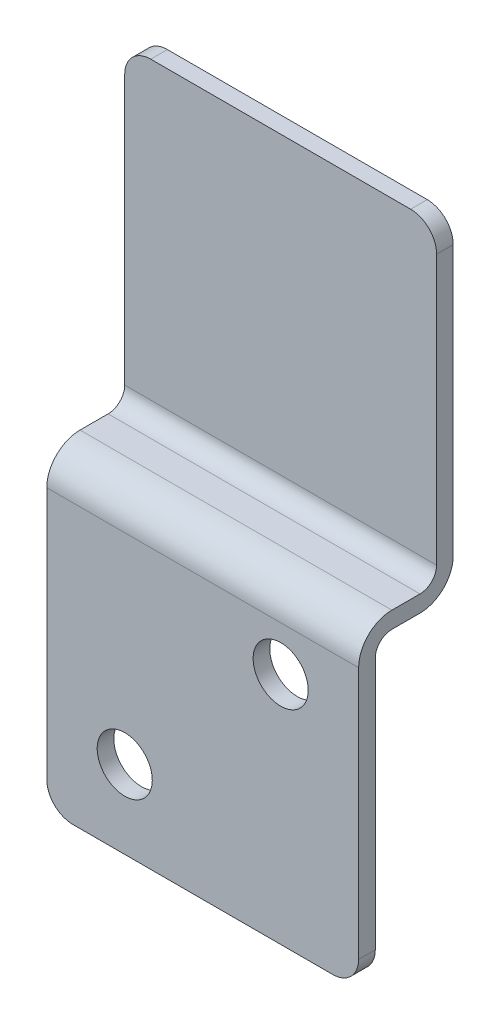
ISO-10303-21;
HEADER;
FILE_DESCRIPTION(('STEP AP214'),'2;1');
FILE_NAME('part.step','',(''),(''),'','','');
FILE_SCHEMA(('AUTOMOTIVE_DESIGN { 1 0 10303 214 1 1 1 1 }'));
ENDSEC;
DATA;
#1=APPLICATION_CONTEXT('core data for automotive mechanical design processes');
#2=APPLICATION_PROTOCOL_DEFINITION('international standard','automotive_design',2000,#1);
#3=PRODUCT_CONTEXT('',#1,'mechanical');
#4=PRODUCT('Part','Part','',(#3));
#5=PRODUCT_RELATED_PRODUCT_CATEGORY('part','',(#4));
#6=PRODUCT_DEFINITION_FORMATION('','',#4);
#7=PRODUCT_DEFINITION_CONTEXT('part definition',#1,'design');
#8=PRODUCT_DEFINITION('design','',#6,#7);
#9=PRODUCT_DEFINITION_SHAPE('','',#8);
#10=(LENGTH_UNIT() NAMED_UNIT(*) SI_UNIT(.MILLI.,.METRE.));
#11=(NAMED_UNIT(*) PLANE_ANGLE_UNIT() SI_UNIT($,.RADIAN.));
#12=(NAMED_UNIT(*) SI_UNIT($,.STERADIAN.) SOLID_ANGLE_UNIT());
#13=UNCERTAINTY_MEASURE_WITH_UNIT(LENGTH_MEASURE(1.E-05),#10,'distance_accuracy_value','');
#14=(GEOMETRIC_REPRESENTATION_CONTEXT(3) GLOBAL_UNCERTAINTY_ASSIGNED_CONTEXT((#13)) GLOBAL_UNIT_ASSIGNED_CONTEXT((#10,
#11,#12)) REPRESENTATION_CONTEXT('',''));
#15=CARTESIAN_POINT('',(0.,0.,0.));
#16=DIRECTION('',(0.,0.,1.));
#17=DIRECTION('',(1.,0.,0.));
#18=AXIS2_PLACEMENT_3D('',#15,#16,#17);
#19=CARTESIAN_POINT('',(38.1,0.,0.));
#20=DIRECTION('',(0.,-1.,0.));
#21=DIRECTION('',(0.,0.,-1.));
#22=AXIS2_PLACEMENT_3D('',#19,#20,#21);
#23=PLANE('',#22);
#24=DIRECTION('',(-1.,0.,0.));
#25=VECTOR('',#24,1.);
#26=CARTESIAN_POINT('',(38.1,0.,-2.032));
#27=LINE('',#26,#25);
#28=CARTESIAN_POINT('',(34.925,0.,-2.032));
#29=VERTEX_POINT('',#28);
#30=CARTESIAN_POINT('',(3.17500000000001,0.,-2.032));
#31=VERTEX_POINT('',#30);
#32=EDGE_CURVE('E192',#29,#31,#27,.T.);
#33=ORIENTED_EDGE('',*,*,#32,.T.);
#34=DIRECTION('',(0.,0.,1.));
#35=VECTOR('',#34,1.);
#36=CARTESIAN_POINT('',(3.175,0.,0.));
#37=LINE('',#36,#35);
#38=CARTESIAN_POINT('',(3.17500000000001,0.,0.));
#39=VERTEX_POINT('',#38);
#40=EDGE_CURVE('E252',#31,#39,#37,.T.);
#41=ORIENTED_EDGE('',*,*,#40,.T.);
#42=DIRECTION('',(-1.,0.,0.));
#43=VECTOR('',#42,1.);
#44=CARTESIAN_POINT('',(38.1,0.,0.));
#45=LINE('',#44,#43);
#46=CARTESIAN_POINT('',(34.925,0.,0.));
#47=VERTEX_POINT('',#46);
#48=EDGE_CURVE('E177',#47,#39,#45,.T.);
#49=ORIENTED_EDGE('',*,*,#48,.F.);
#50=DIRECTION('',(0.,0.,1.));
#51=VECTOR('',#50,1.);
#52=CARTESIAN_POINT('',(34.925,0.,0.));
#53=LINE('',#52,#51);
#54=EDGE_CURVE('E250',#47,#29,#53,.F.);
#55=ORIENTED_EDGE('',*,*,#54,.T.);
#56=EDGE_LOOP('',(#33,#41,#49,#55));
#57=FACE_BOUND('',#56,.T.);
#58=ADVANCED_FACE('F37',(#57),#23,.F.);
#59=CARTESIAN_POINT('',(38.1,0.,0.));
#60=DIRECTION('',(0.,0.,-1.));
#61=DIRECTION('',(0.,1.,0.));
#62=AXIS2_PLACEMENT_3D('',#59,#60,#61);
#63=PLANE('',#62);
#64=ORIENTED_EDGE('',*,*,#48,.T.);
#65=CARTESIAN_POINT('',(3.175,-3.175,0.));
#66=DIRECTION('',(0.,0.,-1.));
#67=DIRECTION('',(0.,1.,0.));
#68=AXIS2_PLACEMENT_3D('',#65,#66,#67);
#69=CIRCLE('',#68,3.175);
#70=CARTESIAN_POINT('',(0.,-3.175,0.));
#71=VERTEX_POINT('',#70);
#72=EDGE_CURVE('E256',#39,#71,#69,.F.);
#73=ORIENTED_EDGE('',*,*,#72,.T.);
#74=DIRECTION('',(0.,-1.,0.));
#75=VECTOR('',#74,1.);
#76=CARTESIAN_POINT('',(0.,0.,0.));
#77=LINE('',#76,#75);
#78=CARTESIAN_POINT('',(0.,-36.068,0.));
#79=VERTEX_POINT('',#78);
#80=EDGE_CURVE('E267',#71,#79,#77,.T.);
#81=ORIENTED_EDGE('',*,*,#80,.T.);
#82=DIRECTION('',(-1.,0.,0.));
#83=VECTOR('',#82,1.);
#84=CARTESIAN_POINT('',(38.1,-36.068,0.));
#85=LINE('',#84,#83);
#86=CARTESIAN_POINT('',(38.1,-36.068,0.));
#87=VERTEX_POINT('',#86);
#88=EDGE_CURVE('E167',#79,#87,#85,.F.);
#89=ORIENTED_EDGE('',*,*,#88,.T.);
#90=DIRECTION('',(0.,-1.,0.));
#91=VECTOR('',#90,1.);
#92=CARTESIAN_POINT('',(38.1,0.,0.));
#93=LINE('',#92,#91);
#94=CARTESIAN_POINT('',(38.1,-3.175,0.));
#95=VERTEX_POINT('',#94);
#96=EDGE_CURVE('E186',#95,#87,#93,.T.);
#97=ORIENTED_EDGE('',*,*,#96,.F.);
#98=CARTESIAN_POINT('',(34.925,-3.175,0.));
#99=DIRECTION('',(0.,0.,-1.));
#100=DIRECTION('',(0.,1.,0.));
#101=AXIS2_PLACEMENT_3D('',#98,#99,#100);
#102=CIRCLE('',#101,3.175);
#103=EDGE_CURVE('E62',#95,#47,#102,.F.);
#104=ORIENTED_EDGE('',*,*,#103,.T.);
#105=EDGE_LOOP('',(#64,#73,#81,#89,#97,#104));
#106=FACE_BOUND('',#105,.T.);
#107=ADVANCED_FACE('F339',(#106),#63,.F.);
#108=CARTESIAN_POINT('',(38.1,-38.1,0.));
#109=DIRECTION('',(0.,-1.,0.));
#110=DIRECTION('',(0.,0.,-1.));
#111=AXIS2_PLACEMENT_3D('',#108,#109,#110);
#112=PLANE('',#111);
#113=DIRECTION('',(0.,0.,1.));
#114=VECTOR('',#113,1.);
#115=CARTESIAN_POINT('',(0.,-38.1,0.));
#116=LINE('',#115,#114);
#117=CARTESIAN_POINT('',(0.,-38.1,2.032));
#118=VERTEX_POINT('',#117);
#119=CARTESIAN_POINT('',(0.,-38.1,5.461));
#120=VERTEX_POINT('',#119);
#121=EDGE_CURVE('E288',#118,#120,#116,.T.);
#122=ORIENTED_EDGE('',*,*,#121,.T.);
#123=DIRECTION('',(-1.,0.,0.));
#124=VECTOR('',#123,1.);
#125=CARTESIAN_POINT('',(38.1,-38.1,5.461));
#126=LINE('',#125,#124);
#127=CARTESIAN_POINT('',(38.1,-38.1,5.461));
#128=VERTEX_POINT('',#127);
#129=EDGE_CURVE('E222',#120,#128,#126,.F.);
#130=ORIENTED_EDGE('',*,*,#129,.T.);
#131=DIRECTION('',(0.,0.,1.));
#132=VECTOR('',#131,1.);
#133=CARTESIAN_POINT('',(38.1,-38.1,0.));
#134=LINE('',#133,#132);
#135=CARTESIAN_POINT('',(38.1,-38.1,2.032));
#136=VERTEX_POINT('',#135);
#137=EDGE_CURVE('E277',#136,#128,#134,.T.);
#138=ORIENTED_EDGE('',*,*,#137,.F.);
#139=DIRECTION('',(-1.,0.,0.));
#140=VECTOR('',#139,1.);
#141=CARTESIAN_POINT('',(0.,-38.1,2.032));
#142=LINE('',#141,#140);
#143=EDGE_CURVE('E205',#136,#118,#142,.T.);
#144=ORIENTED_EDGE('',*,*,#143,.T.);
#145=EDGE_LOOP('',(#122,#130,#138,#144));
#146=FACE_BOUND('',#145,.T.);
#147=ADVANCED_FACE('F321',(#146),#112,.F.);
#148=CARTESIAN_POINT('',(38.1,-38.1,9.525));
#149=DIRECTION('',(0.,0.,-1.));
#150=DIRECTION('',(0.,1.,0.));
#151=AXIS2_PLACEMENT_3D('',#148,#149,#150);
#152=PLANE('',#151);
#153=CARTESIAN_POINT('',(9.525,-66.675,9.52500000000001));
#154=DIRECTION('',(0.,0.,1.));
#155=DIRECTION('',(1.,0.,0.));
#156=AXIS2_PLACEMENT_3D('',#153,#154,#155);
#157=CIRCLE('',#156,3.3655);
#158=CARTESIAN_POINT('',(12.8905,-66.675,9.52500000000001));
#159=VERTEX_POINT('',#158);
#160=EDGE_CURVE('E263',#159,#159,#157,.T.);
#161=ORIENTED_EDGE('',*,*,#160,.F.);
#162=EDGE_LOOP('',(#161));
#163=FACE_BOUND('',#162,.T.);
#164=CARTESIAN_POINT('',(28.575,-47.625,9.52500000000001));
#165=DIRECTION('',(0.,0.,1.));
#166=DIRECTION('',(1.,0.,0.));
#167=AXIS2_PLACEMENT_3D('',#164,#165,#166);
#168=CIRCLE('',#167,3.36549999999999);
#169=CARTESIAN_POINT('',(31.9405,-47.625,9.52500000000001));
#170=VERTEX_POINT('',#169);
#171=EDGE_CURVE('E269',#170,#170,#168,.T.);
#172=ORIENTED_EDGE('',*,*,#171,.F.);
#173=EDGE_LOOP('',(#172));
#174=FACE_BOUND('',#173,.T.);
#175=DIRECTION('',(0.,-1.,0.));
#176=VECTOR('',#175,1.);
#177=CARTESIAN_POINT('',(0.,-38.1,9.525));
#178=LINE('',#177,#176);
#179=CARTESIAN_POINT('',(0.,-42.164,9.525));
#180=VERTEX_POINT('',#179);
#181=CARTESIAN_POINT('',(0.,-73.025,9.52499999999999));
#182=VERTEX_POINT('',#181);
#183=EDGE_CURVE('E188',#180,#182,#178,.T.);
#184=ORIENTED_EDGE('',*,*,#183,.T.);
#185=CARTESIAN_POINT('',(3.175,-73.025,9.52499999999999));
#186=DIRECTION('',(0.,0.,-1.));
#187=DIRECTION('',(0.,1.,0.));
#188=AXIS2_PLACEMENT_3D('',#185,#186,#187);
#189=CIRCLE('',#188,3.175);
#190=CARTESIAN_POINT('',(3.17500000000001,-76.2,9.52499999999999));
#191=VERTEX_POINT('',#190);
#192=EDGE_CURVE('E248',#182,#191,#189,.F.);
#193=ORIENTED_EDGE('',*,*,#192,.T.);
#194=DIRECTION('',(-1.,0.,0.));
#195=VECTOR('',#194,1.);
#196=CARTESIAN_POINT('',(38.1,-76.2,9.52499999999999));
#197=LINE('',#196,#195);
#198=CARTESIAN_POINT('',(34.925,-76.2,9.52499999999999));
#199=VERTEX_POINT('',#198);
#200=EDGE_CURVE('E199',#199,#191,#197,.T.);
#201=ORIENTED_EDGE('',*,*,#200,.F.);
#202=CARTESIAN_POINT('',(34.925,-73.025,9.52499999999999));
#203=DIRECTION('',(0.,0.,-1.));
#204=DIRECTION('',(0.,1.,0.));
#205=AXIS2_PLACEMENT_3D('',#202,#203,#204);
#206=CIRCLE('',#205,3.175);
#207=CARTESIAN_POINT('',(38.1,-73.025,9.52499999999999));
#208=VERTEX_POINT('',#207);
#209=EDGE_CURVE('E246',#199,#208,#206,.F.);
#210=ORIENTED_EDGE('',*,*,#209,.T.);
#211=DIRECTION('',(0.,-1.,0.));
#212=VECTOR('',#211,1.);
#213=CARTESIAN_POINT('',(38.1,-38.1,9.525));
#214=LINE('',#213,#212);
#215=CARTESIAN_POINT('',(38.1,-42.164,9.525));
#216=VERTEX_POINT('',#215);
#217=EDGE_CURVE('E280',#216,#208,#214,.T.);
#218=ORIENTED_EDGE('',*,*,#217,.F.);
#219=DIRECTION('',(-1.,0.,0.));
#220=VECTOR('',#219,1.);
#221=CARTESIAN_POINT('',(38.1,-42.164,9.525));
#222=LINE('',#221,#220);
#223=EDGE_CURVE('E216',#216,#180,#222,.T.);
#224=ORIENTED_EDGE('',*,*,#223,.T.);
#225=EDGE_LOOP('',(#184,#193,#201,#210,#218,#224));
#226=FACE_BOUND('',#225,.T.);
#227=ADVANCED_FACE('F294',(#163,#174,#226),#152,.F.);
#228=CARTESIAN_POINT('',(38.1,-76.2,9.52499999999999));
#229=DIRECTION('',(0.,1.,0.));
#230=DIRECTION('',(0.,0.,1.));
#231=AXIS2_PLACEMENT_3D('',#228,#229,#230);
#232=PLANE('',#231);
#233=ORIENTED_EDGE('',*,*,#200,.T.);
#234=DIRECTION('',(0.,0.,-1.));
#235=VECTOR('',#234,1.);
#236=CARTESIAN_POINT('',(3.175,-76.2,7.49299999999999));
#237=LINE('',#236,#235);
#238=CARTESIAN_POINT('',(3.17500000000001,-76.2,7.49299999999999));
#239=VERTEX_POINT('',#238);
#240=EDGE_CURVE('E235',#191,#239,#237,.T.);
#241=ORIENTED_EDGE('',*,*,#240,.T.);
#242=DIRECTION('',(-1.,0.,0.));
#243=VECTOR('',#242,1.);
#244=CARTESIAN_POINT('',(38.1,-76.2,7.49299999999999));
#245=LINE('',#244,#243);
#246=CARTESIAN_POINT('',(34.925,-76.2,7.49299999999999));
#247=VERTEX_POINT('',#246);
#248=EDGE_CURVE('E195',#247,#239,#245,.T.);
#249=ORIENTED_EDGE('',*,*,#248,.F.);
#250=DIRECTION('',(0.,0.,-1.));
#251=VECTOR('',#250,1.);
#252=CARTESIAN_POINT('',(34.925,-76.2,9.52499999999999));
#253=LINE('',#252,#251);
#254=EDGE_CURVE('E233',#247,#199,#253,.F.);
#255=ORIENTED_EDGE('',*,*,#254,.T.);
#256=EDGE_LOOP('',(#233,#241,#249,#255));
#257=FACE_BOUND('',#256,.T.);
#258=ADVANCED_FACE('F304',(#257),#232,.F.);
#259=CARTESIAN_POINT('',(38.1,-40.132,7.493));
#260=DIRECTION('',(0.,0.,1.));
#261=DIRECTION('',(0.,-1.,0.));
#262=AXIS2_PLACEMENT_3D('',#259,#260,#261);
#263=PLANE('',#262);
#264=CARTESIAN_POINT('',(9.525,-66.675,7.49299999999999));
#265=DIRECTION('',(0.,0.,1.));
#266=DIRECTION('',(0.,-1.,0.));
#267=AXIS2_PLACEMENT_3D('',#264,#265,#266);
#268=CIRCLE('',#267,3.3655);
#269=CARTESIAN_POINT('',(9.525,-70.0405,7.49299999999999));
#270=VERTEX_POINT('',#269);
#271=EDGE_CURVE('E41',#270,#270,#268,.T.);
#272=ORIENTED_EDGE('',*,*,#271,.T.);
#273=EDGE_LOOP('',(#272));
#274=FACE_BOUND('',#273,.T.);
#275=CARTESIAN_POINT('',(28.575,-47.625,7.493));
#276=DIRECTION('',(0.,0.,1.));
#277=DIRECTION('',(0.,-1.,0.));
#278=AXIS2_PLACEMENT_3D('',#275,#276,#277);
#279=CIRCLE('',#278,3.36549999999999);
#280=CARTESIAN_POINT('',(28.575,-50.9905,7.493));
#281=VERTEX_POINT('',#280);
#282=EDGE_CURVE('E261',#281,#281,#279,.T.);
#283=ORIENTED_EDGE('',*,*,#282,.T.);
#284=EDGE_LOOP('',(#283));
#285=FACE_BOUND('',#284,.T.);
#286=ORIENTED_EDGE('',*,*,#248,.T.);
#287=CARTESIAN_POINT('',(3.175,-73.025,7.49299999999999));
#288=DIRECTION('',(0.,0.,1.));
#289=DIRECTION('',(0.,-1.,0.));
#290=AXIS2_PLACEMENT_3D('',#287,#288,#289);
#291=CIRCLE('',#290,3.175);
#292=CARTESIAN_POINT('',(0.,-73.025,7.49299999999999));
#293=VERTEX_POINT('',#292);
#294=EDGE_CURVE('E240',#239,#293,#291,.F.);
#295=ORIENTED_EDGE('',*,*,#294,.T.);
#296=DIRECTION('',(0.,1.,0.));
#297=VECTOR('',#296,1.);
#298=CARTESIAN_POINT('',(0.,-40.132,7.493));
#299=LINE('',#298,#297);
#300=CARTESIAN_POINT('',(0.,-42.164,7.493));
#301=VERTEX_POINT('',#300);
#302=EDGE_CURVE('E183',#293,#301,#299,.T.);
#303=ORIENTED_EDGE('',*,*,#302,.T.);
#304=DIRECTION('',(-1.,0.,0.));
#305=VECTOR('',#304,1.);
#306=CARTESIAN_POINT('',(38.1,-42.164,7.493));
#307=LINE('',#306,#305);
#308=CARTESIAN_POINT('',(38.1,-42.164,7.493));
#309=VERTEX_POINT('',#308);
#310=EDGE_CURVE('E162',#301,#309,#307,.F.);
#311=ORIENTED_EDGE('',*,*,#310,.T.);
#312=DIRECTION('',(0.,1.,0.));
#313=VECTOR('',#312,1.);
#314=CARTESIAN_POINT('',(38.1,-40.132,7.493));
#315=LINE('',#314,#313);
#316=CARTESIAN_POINT('',(38.1,-73.025,7.49299999999999));
#317=VERTEX_POINT('',#316);
#318=EDGE_CURVE('E283',#317,#309,#315,.T.);
#319=ORIENTED_EDGE('',*,*,#318,.F.);
#320=CARTESIAN_POINT('',(34.925,-73.025,7.49299999999999));
#321=DIRECTION('',(0.,0.,1.));
#322=DIRECTION('',(0.,-1.,0.));
#323=AXIS2_PLACEMENT_3D('',#320,#321,#322);
#324=CIRCLE('',#323,3.175);
#325=EDGE_CURVE('E238',#317,#247,#324,.F.);
#326=ORIENTED_EDGE('',*,*,#325,.T.);
#327=EDGE_LOOP('',(#286,#295,#303,#311,#319,#326));
#328=FACE_BOUND('',#327,.T.);
#329=ADVANCED_FACE('F307',(#274,#285,#328),#263,.F.);
#330=CARTESIAN_POINT('',(38.1,-40.132,-2.032));
#331=DIRECTION('',(0.,1.,0.));
#332=DIRECTION('',(0.,0.,1.));
#333=AXIS2_PLACEMENT_3D('',#330,#331,#332);
#334=PLANE('',#333);
#335=DIRECTION('',(0.,0.,-1.));
#336=VECTOR('',#335,1.);
#337=CARTESIAN_POINT('',(0.,-40.132,-2.032));
#338=LINE('',#337,#336);
#339=CARTESIAN_POINT('',(0.,-40.132,5.461));
#340=VERTEX_POINT('',#339);
#341=CARTESIAN_POINT('',(0.,-40.132,2.032));
#342=VERTEX_POINT('',#341);
#343=EDGE_CURVE('E173',#340,#342,#338,.T.);
#344=ORIENTED_EDGE('',*,*,#343,.T.);
#345=DIRECTION('',(-1.,0.,0.));
#346=VECTOR('',#345,1.);
#347=CARTESIAN_POINT('',(38.1,-40.132,2.032));
#348=LINE('',#347,#346);
#349=CARTESIAN_POINT('',(38.1,-40.132,2.032));
#350=VERTEX_POINT('',#349);
#351=EDGE_CURVE('E231',#342,#350,#348,.F.);
#352=ORIENTED_EDGE('',*,*,#351,.T.);
#353=DIRECTION('',(0.,0.,-1.));
#354=VECTOR('',#353,1.);
#355=CARTESIAN_POINT('',(38.1,-40.132,-2.032));
#356=LINE('',#355,#354);
#357=CARTESIAN_POINT('',(38.1,-40.132,5.461));
#358=VERTEX_POINT('',#357);
#359=EDGE_CURVE('E176',#358,#350,#356,.T.);
#360=ORIENTED_EDGE('',*,*,#359,.F.);
#361=DIRECTION('',(-1.,0.,0.));
#362=VECTOR('',#361,1.);
#363=CARTESIAN_POINT('',(0.,-40.132,5.461));
#364=LINE('',#363,#362);
#365=EDGE_CURVE('E160',#358,#340,#364,.T.);
#366=ORIENTED_EDGE('',*,*,#365,.T.);
#367=EDGE_LOOP('',(#344,#352,#360,#366));
#368=FACE_BOUND('',#367,.T.);
#369=ADVANCED_FACE('F172',(#368),#334,.F.);
#370=CARTESIAN_POINT('',(38.1,0.,-2.032));
#371=DIRECTION('',(0.,0.,1.));
#372=DIRECTION('',(0.,-1.,0.));
#373=AXIS2_PLACEMENT_3D('',#370,#371,#372);
#374=PLANE('',#373);
#375=DIRECTION('',(0.,1.,0.));
#376=VECTOR('',#375,1.);
#377=CARTESIAN_POINT('',(0.,0.,-2.032));
#378=LINE('',#377,#376);
#379=CARTESIAN_POINT('',(0.,-36.068,-2.032));
#380=VERTEX_POINT('',#379);
#381=CARTESIAN_POINT('',(0.,-3.175,-2.032));
#382=VERTEX_POINT('',#381);
#383=EDGE_CURVE('E182',#380,#382,#378,.T.);
#384=ORIENTED_EDGE('',*,*,#383,.T.);
#385=CARTESIAN_POINT('',(3.175,-3.175,-2.032));
#386=DIRECTION('',(0.,0.,1.));
#387=DIRECTION('',(0.,-1.,0.));
#388=AXIS2_PLACEMENT_3D('',#385,#386,#387);
#389=CIRCLE('',#388,3.175);
#390=EDGE_CURVE('E259',#382,#31,#389,.F.);
#391=ORIENTED_EDGE('',*,*,#390,.T.);
#392=ORIENTED_EDGE('',*,*,#32,.F.);
#393=CARTESIAN_POINT('',(34.925,-3.175,-2.032));
#394=DIRECTION('',(0.,0.,1.));
#395=DIRECTION('',(0.,-1.,0.));
#396=AXIS2_PLACEMENT_3D('',#393,#394,#395);
#397=CIRCLE('',#396,3.175);
#398=CARTESIAN_POINT('',(38.1,-3.175,-2.032));
#399=VERTEX_POINT('',#398);
#400=EDGE_CURVE('E54',#29,#399,#397,.F.);
#401=ORIENTED_EDGE('',*,*,#400,.T.);
#402=DIRECTION('',(0.,1.,0.));
#403=VECTOR('',#402,1.);
#404=CARTESIAN_POINT('',(38.1,0.,-2.032));
#405=LINE('',#404,#403);
#406=CARTESIAN_POINT('',(38.1,-36.068,-2.032));
#407=VERTEX_POINT('',#406);
#408=EDGE_CURVE('E196',#407,#399,#405,.T.);
#409=ORIENTED_EDGE('',*,*,#408,.F.);
#410=DIRECTION('',(-1.,0.,0.));
#411=VECTOR('',#410,1.);
#412=CARTESIAN_POINT('',(38.1,-36.068,-2.032));
#413=LINE('',#412,#411);
#414=EDGE_CURVE('E228',#407,#380,#413,.T.);
#415=ORIENTED_EDGE('',*,*,#414,.T.);
#416=EDGE_LOOP('',(#384,#391,#392,#401,#409,#415));
#417=FACE_BOUND('',#416,.T.);
#418=ADVANCED_FACE('F335',(#417),#374,.F.);
#419=CARTESIAN_POINT('',(38.1,0.,0.));
#420=DIRECTION('',(-1.,0.,0.));
#421=DIRECTION('',(0.,0.,1.));
#422=AXIS2_PLACEMENT_3D('',#419,#420,#421);
#423=PLANE('',#422);
#424=ORIENTED_EDGE('',*,*,#217,.T.);
#425=DIRECTION('',(0.,0.,-1.));
#426=VECTOR('',#425,1.);
#427=CARTESIAN_POINT('',(38.1,-73.025,0.));
#428=LINE('',#427,#426);
#429=EDGE_CURVE('E11',#208,#317,#428,.T.);
#430=ORIENTED_EDGE('',*,*,#429,.T.);
#431=ORIENTED_EDGE('',*,*,#318,.T.);
#432=CARTESIAN_POINT('',(38.1,-42.164,5.461));
#433=DIRECTION('',(-1.,0.,0.));
#434=DIRECTION('',(0.,0.,1.));
#435=AXIS2_PLACEMENT_3D('',#432,#433,#434);
#436=CIRCLE('',#435,2.032);
#437=EDGE_CURVE('E166',#309,#358,#436,.T.);
#438=ORIENTED_EDGE('',*,*,#437,.T.);
#439=ORIENTED_EDGE('',*,*,#359,.T.);
#440=CARTESIAN_POINT('',(38.1,-36.068,2.03199999999999));
#441=DIRECTION('',(-1.,0.,0.));
#442=DIRECTION('',(0.,0.,1.));
#443=AXIS2_PLACEMENT_3D('',#440,#441,#442);
#444=CIRCLE('',#443,4.064);
#445=EDGE_CURVE('E224',#350,#407,#444,.F.);
#446=ORIENTED_EDGE('',*,*,#445,.T.);
#447=ORIENTED_EDGE('',*,*,#408,.T.);
#448=DIRECTION('',(0.,0.,1.));
#449=VECTOR('',#448,1.);
#450=CARTESIAN_POINT('',(38.1,-3.175,0.));
#451=LINE('',#450,#449);
#452=EDGE_CURVE('E46',#399,#95,#451,.T.);
#453=ORIENTED_EDGE('',*,*,#452,.T.);
#454=ORIENTED_EDGE('',*,*,#96,.T.);
#455=CARTESIAN_POINT('',(38.1,-36.068,2.032));
#456=DIRECTION('',(-1.,0.,0.));
#457=DIRECTION('',(0.,0.,1.));
#458=AXIS2_PLACEMENT_3D('',#455,#456,#457);
#459=CIRCLE('',#458,2.032);
#460=EDGE_CURVE('E214',#87,#136,#459,.T.);
#461=ORIENTED_EDGE('',*,*,#460,.T.);
#462=ORIENTED_EDGE('',*,*,#137,.T.);
#463=CARTESIAN_POINT('',(38.1,-42.164,5.461));
#464=DIRECTION('',(-1.,0.,0.));
#465=DIRECTION('',(0.,0.,1.));
#466=AXIS2_PLACEMENT_3D('',#463,#464,#465);
#467=CIRCLE('',#466,4.064);
#468=EDGE_CURVE('E226',#128,#216,#467,.F.);
#469=ORIENTED_EDGE('',*,*,#468,.T.);
#470=EDGE_LOOP('',(#424,#430,#431,#438,#439,#446,#447,#453,#454,#461,#462,#469));
#471=FACE_BOUND('',#470,.T.);
#472=ADVANCED_FACE('F314',(#471),#423,.F.);
#473=CARTESIAN_POINT('',(0.,0.,0.));
#474=DIRECTION('',(-1.,0.,0.));
#475=DIRECTION('',(0.,0.,1.));
#476=AXIS2_PLACEMENT_3D('',#473,#474,#475);
#477=PLANE('',#476);
#478=ORIENTED_EDGE('',*,*,#302,.F.);
#479=DIRECTION('',(0.,0.,-1.));
#480=VECTOR('',#479,1.);
#481=CARTESIAN_POINT('',(0.,-73.025,9.52499999999999));
#482=LINE('',#481,#480);
#483=EDGE_CURVE('E244',#293,#182,#482,.F.);
#484=ORIENTED_EDGE('',*,*,#483,.T.);
#485=ORIENTED_EDGE('',*,*,#183,.F.);
#486=CARTESIAN_POINT('',(0.,-42.164,5.461));
#487=DIRECTION('',(-1.,0.,0.));
#488=DIRECTION('',(0.,0.,1.));
#489=AXIS2_PLACEMENT_3D('',#486,#487,#488);
#490=CIRCLE('',#489,4.064);
#491=EDGE_CURVE('E220',#180,#120,#490,.T.);
#492=ORIENTED_EDGE('',*,*,#491,.T.);
#493=ORIENTED_EDGE('',*,*,#121,.F.);
#494=CARTESIAN_POINT('',(0.,-36.068,2.032));
#495=DIRECTION('',(-1.,0.,0.));
#496=DIRECTION('',(0.,0.,1.));
#497=AXIS2_PLACEMENT_3D('',#494,#495,#496);
#498=CIRCLE('',#497,2.032);
#499=EDGE_CURVE('E211',#118,#79,#498,.F.);
#500=ORIENTED_EDGE('',*,*,#499,.T.);
#501=ORIENTED_EDGE('',*,*,#80,.F.);
#502=DIRECTION('',(0.,0.,1.));
#503=VECTOR('',#502,1.);
#504=CARTESIAN_POINT('',(0.,-3.175,-2.032));
#505=LINE('',#504,#503);
#506=EDGE_CURVE('E242',#71,#382,#505,.F.);
#507=ORIENTED_EDGE('',*,*,#506,.T.);
#508=ORIENTED_EDGE('',*,*,#383,.F.);
#509=CARTESIAN_POINT('',(0.,-36.068,2.03199999999999));
#510=DIRECTION('',(-1.,0.,0.));
#511=DIRECTION('',(0.,0.,1.));
#512=AXIS2_PLACEMENT_3D('',#509,#510,#511);
#513=CIRCLE('',#512,4.064);
#514=EDGE_CURVE('E181',#380,#342,#513,.T.);
#515=ORIENTED_EDGE('',*,*,#514,.T.);
#516=ORIENTED_EDGE('',*,*,#343,.F.);
#517=CARTESIAN_POINT('',(0.,-42.164,5.461));
#518=DIRECTION('',(-1.,0.,0.));
#519=DIRECTION('',(0.,0.,1.));
#520=AXIS2_PLACEMENT_3D('',#517,#518,#519);
#521=CIRCLE('',#520,2.032);
#522=EDGE_CURVE('E156',#340,#301,#521,.F.);
#523=ORIENTED_EDGE('',*,*,#522,.T.);
#524=EDGE_LOOP('',(#478,#484,#485,#492,#493,#500,#501,#507,#508,#515,#516,#523));
#525=FACE_BOUND('',#524,.T.);
#526=ADVANCED_FACE('F179',(#525),#477,.T.);
#527=CARTESIAN_POINT('',(38.1,-42.164,5.461));
#528=DIRECTION('',(1.,0.,0.));
#529=DIRECTION('',(0.,0.,-1.));
#530=AXIS2_PLACEMENT_3D('',#527,#528,#529);
#531=CYLINDRICAL_SURFACE('',#530,2.032);
#532=ORIENTED_EDGE('',*,*,#437,.F.);
#533=ORIENTED_EDGE('',*,*,#310,.F.);
#534=ORIENTED_EDGE('',*,*,#522,.F.);
#535=ORIENTED_EDGE('',*,*,#365,.F.);
#536=EDGE_LOOP('',(#532,#533,#534,#535));
#537=FACE_BOUND('',#536,.T.);
#538=ADVANCED_FACE('F159',(#537),#531,.F.);
#539=CARTESIAN_POINT('',(38.1,-36.068,2.032));
#540=DIRECTION('',(1.,0.,0.));
#541=DIRECTION('',(0.,0.,-1.));
#542=AXIS2_PLACEMENT_3D('',#539,#540,#541);
#543=CYLINDRICAL_SURFACE('',#542,2.032);
#544=ORIENTED_EDGE('',*,*,#460,.F.);
#545=ORIENTED_EDGE('',*,*,#88,.F.);
#546=ORIENTED_EDGE('',*,*,#499,.F.);
#547=ORIENTED_EDGE('',*,*,#143,.F.);
#548=EDGE_LOOP('',(#544,#545,#546,#547));
#549=FACE_BOUND('',#548,.T.);
#550=ADVANCED_FACE('F326',(#549),#543,.F.);
#551=CARTESIAN_POINT('',(38.1,-42.164,5.461));
#552=DIRECTION('',(-1.,0.,0.));
#553=DIRECTION('',(0.,0.,1.));
#554=AXIS2_PLACEMENT_3D('',#551,#552,#553);
#555=CYLINDRICAL_SURFACE('',#554,4.064);
#556=ORIENTED_EDGE('',*,*,#468,.F.);
#557=ORIENTED_EDGE('',*,*,#129,.F.);
#558=ORIENTED_EDGE('',*,*,#491,.F.);
#559=ORIENTED_EDGE('',*,*,#223,.F.);
#560=EDGE_LOOP('',(#556,#557,#558,#559));
#561=FACE_BOUND('',#560,.T.);
#562=ADVANCED_FACE('F317',(#561),#555,.T.);
#563=CARTESIAN_POINT('',(38.1,-36.068,2.03199999999999));
#564=DIRECTION('',(-1.,0.,0.));
#565=DIRECTION('',(0.,0.,1.));
#566=AXIS2_PLACEMENT_3D('',#563,#564,#565);
#567=CYLINDRICAL_SURFACE('',#566,4.064);
#568=ORIENTED_EDGE('',*,*,#445,.F.);
#569=ORIENTED_EDGE('',*,*,#351,.F.);
#570=ORIENTED_EDGE('',*,*,#514,.F.);
#571=ORIENTED_EDGE('',*,*,#414,.F.);
#572=EDGE_LOOP('',(#568,#569,#570,#571));
#573=FACE_BOUND('',#572,.T.);
#574=ADVANCED_FACE('F357',(#573),#567,.T.);
#575=CARTESIAN_POINT('',(3.175,-73.025,9.52499999999999));
#576=DIRECTION('',(0.,0.,1.));
#577=DIRECTION('',(1.,0.,0.));
#578=AXIS2_PLACEMENT_3D('',#575,#576,#577);
#579=CYLINDRICAL_SURFACE('',#578,3.175);
#580=ORIENTED_EDGE('',*,*,#192,.F.);
#581=ORIENTED_EDGE('',*,*,#483,.F.);
#582=ORIENTED_EDGE('',*,*,#294,.F.);
#583=ORIENTED_EDGE('',*,*,#240,.F.);
#584=EDGE_LOOP('',(#580,#581,#582,#583));
#585=FACE_BOUND('',#584,.T.);
#586=ADVANCED_FACE('F301',(#585),#579,.T.);
#587=CARTESIAN_POINT('',(3.175,-3.175,0.));
#588=DIRECTION('',(0.,0.,-1.));
#589=DIRECTION('',(-1.,0.,0.));
#590=AXIS2_PLACEMENT_3D('',#587,#588,#589);
#591=CYLINDRICAL_SURFACE('',#590,3.175);
#592=ORIENTED_EDGE('',*,*,#390,.F.);
#593=ORIENTED_EDGE('',*,*,#506,.F.);
#594=ORIENTED_EDGE('',*,*,#72,.F.);
#595=ORIENTED_EDGE('',*,*,#40,.F.);
#596=EDGE_LOOP('',(#592,#593,#594,#595));
#597=FACE_BOUND('',#596,.T.);
#598=ADVANCED_FACE('F333',(#597),#591,.T.);
#599=CARTESIAN_POINT('',(34.925,-73.025,0.));
#600=DIRECTION('',(0.,0.,-1.));
#601=DIRECTION('',(-1.,0.,0.));
#602=AXIS2_PLACEMENT_3D('',#599,#600,#601);
#603=CYLINDRICAL_SURFACE('',#602,3.175);
#604=ORIENTED_EDGE('',*,*,#209,.F.);
#605=ORIENTED_EDGE('',*,*,#254,.F.);
#606=ORIENTED_EDGE('',*,*,#325,.F.);
#607=ORIENTED_EDGE('',*,*,#429,.F.);
#608=EDGE_LOOP('',(#604,#605,#606,#607));
#609=FACE_BOUND('',#608,.T.);
#610=ADVANCED_FACE('F312',(#609),#603,.T.);
#611=CARTESIAN_POINT('',(34.925,-3.175,0.));
#612=DIRECTION('',(0.,0.,1.));
#613=DIRECTION('',(1.,0.,0.));
#614=AXIS2_PLACEMENT_3D('',#611,#612,#613);
#615=CYLINDRICAL_SURFACE('',#614,3.175);
#616=ORIENTED_EDGE('',*,*,#400,.F.);
#617=ORIENTED_EDGE('',*,*,#54,.F.);
#618=ORIENTED_EDGE('',*,*,#103,.F.);
#619=ORIENTED_EDGE('',*,*,#452,.F.);
#620=EDGE_LOOP('',(#616,#617,#618,#619));
#621=FACE_BOUND('',#620,.T.);
#622=ADVANCED_FACE('F39',(#621),#615,.T.);
#623=CARTESIAN_POINT('',(28.575,-47.625,-2.03200000000001));
#624=DIRECTION('',(0.,0.,1.));
#625=DIRECTION('',(1.,0.,0.));
#626=AXIS2_PLACEMENT_3D('',#623,#624,#625);
#627=CYLINDRICAL_SURFACE('',#626,3.36549999999999);
#628=ORIENTED_EDGE('',*,*,#171,.T.);
#629=EDGE_LOOP('',(#628));
#630=FACE_BOUND('',#629,.T.);
#631=ORIENTED_EDGE('',*,*,#282,.F.);
#632=EDGE_LOOP('',(#631));
#633=FACE_BOUND('',#632,.T.);
#634=ADVANCED_FACE('F368',(#630,#633),#627,.F.);
#635=CARTESIAN_POINT('',(9.525,-66.675,-2.03200000000001));
#636=DIRECTION('',(0.,0.,1.));
#637=DIRECTION('',(1.,0.,0.));
#638=AXIS2_PLACEMENT_3D('',#635,#636,#637);
#639=CYLINDRICAL_SURFACE('',#638,3.3655);
#640=ORIENTED_EDGE('',*,*,#160,.T.);
#641=EDGE_LOOP('',(#640));
#642=FACE_BOUND('',#641,.T.);
#643=ORIENTED_EDGE('',*,*,#271,.F.);
#644=EDGE_LOOP('',(#643));
#645=FACE_BOUND('',#644,.T.);
#646=ADVANCED_FACE('F373',(#642,#645),#639,.F.);
#647=CLOSED_SHELL('',(#58,#107,#147,#227,#258,#329,#369,#418,#472,#526,#538,#550,#562,#574,#586,
#598,#610,#622,#634,#646));
#648=MANIFOLD_SOLID_BREP('B2',#647);
#649=ADVANCED_BREP_SHAPE_REPRESENTATION('',(#18,#648),#14);
#650=SHAPE_DEFINITION_REPRESENTATION(#9,#649);
ENDSEC;
END-ISO-10303-21;
